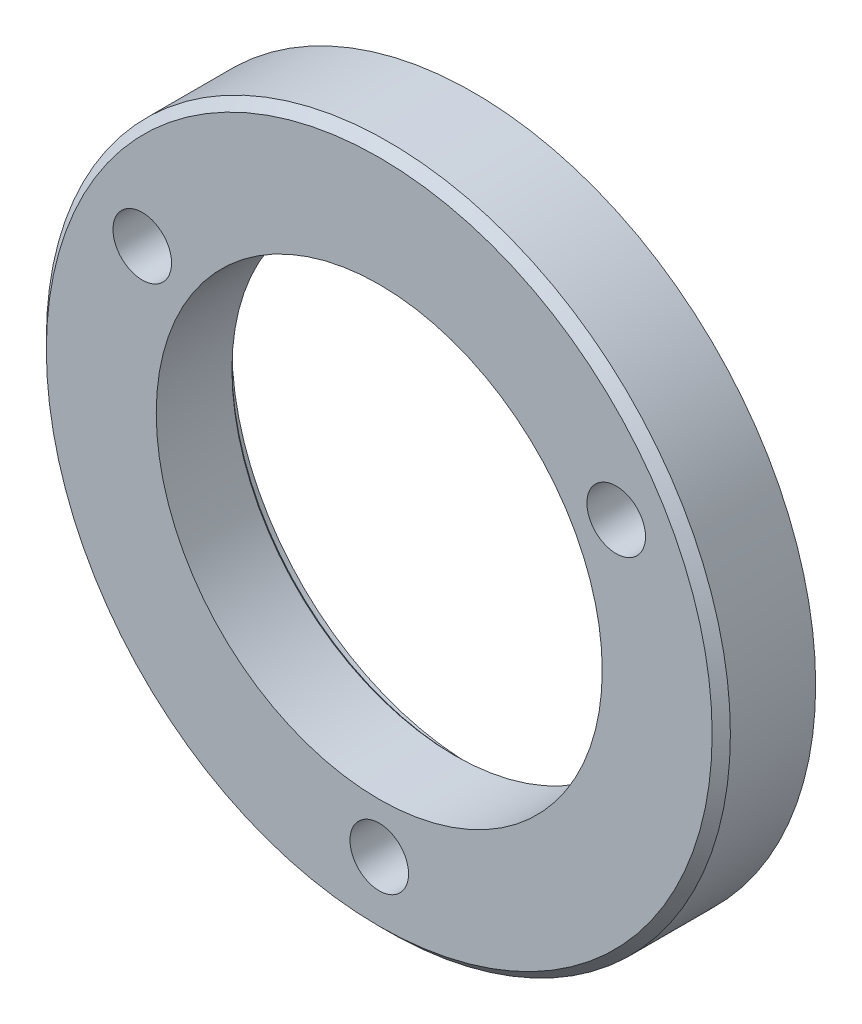
ISO-10303-21;
HEADER;
FILE_DESCRIPTION(('STEP AP214'),'2;1');
FILE_NAME('part.step','',(''),(''),'','','');
FILE_SCHEMA(('AUTOMOTIVE_DESIGN { 1 0 10303 214 1 1 1 1 }'));
ENDSEC;
DATA;
#1=APPLICATION_CONTEXT('core data for automotive mechanical design processes');
#2=APPLICATION_PROTOCOL_DEFINITION('international standard','automotive_design',2000,#1);
#3=PRODUCT_CONTEXT('',#1,'mechanical');
#4=PRODUCT('Part','Part','',(#3));
#5=PRODUCT_RELATED_PRODUCT_CATEGORY('part','',(#4));
#6=PRODUCT_DEFINITION_FORMATION('','',#4);
#7=PRODUCT_DEFINITION_CONTEXT('part definition',#1,'design');
#8=PRODUCT_DEFINITION('design','',#6,#7);
#9=PRODUCT_DEFINITION_SHAPE('','',#8);
#10=(LENGTH_UNIT() NAMED_UNIT(*) SI_UNIT(.MILLI.,.METRE.));
#11=(NAMED_UNIT(*) PLANE_ANGLE_UNIT() SI_UNIT($,.RADIAN.));
#12=(NAMED_UNIT(*) SI_UNIT($,.STERADIAN.) SOLID_ANGLE_UNIT());
#13=UNCERTAINTY_MEASURE_WITH_UNIT(LENGTH_MEASURE(1.E-05),#10,'distance_accuracy_value','');
#14=(GEOMETRIC_REPRESENTATION_CONTEXT(3) GLOBAL_UNCERTAINTY_ASSIGNED_CONTEXT((#13)) GLOBAL_UNIT_ASSIGNED_CONTEXT((#10,
#11,#12)) REPRESENTATION_CONTEXT('',''));
#15=CARTESIAN_POINT('',(0.,0.,0.));
#16=DIRECTION('',(0.,0.,1.));
#17=DIRECTION('',(1.,0.,0.));
#18=AXIS2_PLACEMENT_3D('',#15,#16,#17);
#19=CARTESIAN_POINT('',(-8.51449043835902,61.3890451015479,4.3688));
#20=DIRECTION('',(0.,0.,1.));
#21=DIRECTION('',(1.,0.,0.));
#22=AXIS2_PLACEMENT_3D('',#19,#20,#21);
#23=PLANE('',#22);
#24=CARTESIAN_POINT('',(-8.51449043835902,61.3890451015479,4.3688));
#25=DIRECTION('',(0.,0.,1.));
#26=DIRECTION('',(1.,0.,0.));
#27=AXIS2_PLACEMENT_3D('',#24,#25,#26);
#28=CIRCLE('',#27,18.542);
#29=CARTESIAN_POINT('',(10.027509561641,61.3890451015479,4.3688));
#30=VERTEX_POINT('',#29);
#31=EDGE_CURVE('E157',#30,#30,#28,.T.);
#32=ORIENTED_EDGE('',*,*,#31,.T.);
#33=EDGE_LOOP('',(#32));
#34=FACE_BOUND('',#33,.T.);
#35=CARTESIAN_POINT('',(4.68373671531574,69.0504183258604,4.3688));
#36=DIRECTION('',(0.,0.,1.));
#37=DIRECTION('',(1.,0.,0.));
#38=AXIS2_PLACEMENT_3D('',#35,#36,#37);
#39=CIRCLE('',#38,1.63194999999999);
#40=CARTESIAN_POINT('',(6.31568671531573,69.0504183258604,4.3688));
#41=VERTEX_POINT('',#40);
#42=EDGE_CURVE('E197',#41,#41,#39,.T.);
#43=ORIENTED_EDGE('',*,*,#42,.F.);
#44=EDGE_LOOP('',(#43));
#45=FACE_BOUND('',#44,.T.);
#46=CARTESIAN_POINT('',(-21.7127175920339,69.0504183258604,4.3688));
#47=DIRECTION('',(0.,0.,1.));
#48=DIRECTION('',(1.,0.,0.));
#49=AXIS2_PLACEMENT_3D('',#46,#47,#48);
#50=CIRCLE('',#49,1.63194999999999);
#51=CARTESIAN_POINT('',(-20.0807675920339,69.0504183258604,4.3688));
#52=VERTEX_POINT('',#51);
#53=EDGE_CURVE('E191',#52,#52,#50,.T.);
#54=ORIENTED_EDGE('',*,*,#53,.F.);
#55=EDGE_LOOP('',(#54));
#56=FACE_BOUND('',#55,.T.);
#57=CARTESIAN_POINT('',(-8.51449043835907,46.1904183258603,4.3688));
#58=DIRECTION('',(0.,0.,1.));
#59=DIRECTION('',(1.,0.,0.));
#60=AXIS2_PLACEMENT_3D('',#57,#58,#59);
#61=CIRCLE('',#60,1.63194999999999);
#62=CARTESIAN_POINT('',(-6.88254043835908,46.1904183258603,4.3688));
#63=VERTEX_POINT('',#62);
#64=EDGE_CURVE('E185',#63,#63,#61,.T.);
#65=ORIENTED_EDGE('',*,*,#64,.F.);
#66=EDGE_LOOP('',(#65));
#67=FACE_BOUND('',#66,.T.);
#68=CARTESIAN_POINT('',(-8.51449043835902,61.3890451015479,4.3688));
#69=DIRECTION('',(0.,0.,1.));
#70=DIRECTION('',(1.,0.,0.));
#71=AXIS2_PLACEMENT_3D('',#68,#69,#70);
#72=CIRCLE('',#71,12.4206);
#73=CARTESIAN_POINT('',(3.90610956164097,61.3890451015479,4.3688));
#74=VERTEX_POINT('',#73);
#75=EDGE_CURVE('E170',#74,#74,#72,.T.);
#76=ORIENTED_EDGE('',*,*,#75,.F.);
#77=EDGE_LOOP('',(#76));
#78=FACE_BOUND('',#77,.T.);
#79=ADVANCED_FACE('F150',(#34,#45,#56,#67,#78),#23,.T.);
#80=CARTESIAN_POINT('',(-8.51449043835902,61.3890451015479,0.));
#81=DIRECTION('',(0.,0.,1.));
#82=DIRECTION('',(1.,0.,0.));
#83=AXIS2_PLACEMENT_3D('',#80,#81,#82);
#84=PLANE('',#83);
#85=CARTESIAN_POINT('',(-8.51449043835902,61.3890451015479,0.));
#86=DIRECTION('',(0.,0.,1.));
#87=DIRECTION('',(1.,0.,0.));
#88=AXIS2_PLACEMENT_3D('',#85,#86,#87);
#89=CIRCLE('',#88,12.573);
#90=CARTESIAN_POINT('',(4.05850956164098,61.3890451015479,0.));
#91=VERTEX_POINT('',#90);
#92=EDGE_CURVE('E165',#91,#91,#89,.T.);
#93=ORIENTED_EDGE('',*,*,#92,.T.);
#94=EDGE_LOOP('',(#93));
#95=FACE_BOUND('',#94,.T.);
#96=CARTESIAN_POINT('',(-8.51449043835902,61.3890451015479,0.));
#97=DIRECTION('',(0.,0.,-1.));
#98=DIRECTION('',(-1.,0.,0.));
#99=AXIS2_PLACEMENT_3D('',#96,#97,#98);
#100=CIRCLE('',#99,13.462);
#101=CARTESIAN_POINT('',(-21.976490438359,61.3890451015479,0.));
#102=VERTEX_POINT('',#101);
#103=EDGE_CURVE('E177',#102,#102,#100,.T.);
#104=ORIENTED_EDGE('',*,*,#103,.T.);
#105=EDGE_LOOP('',(#104));
#106=FACE_BOUND('',#105,.T.);
#107=ADVANCED_FACE('F205',(#95,#106),#84,.F.);
#108=CARTESIAN_POINT('',(-8.51449043835902,61.3890451015479,4.3688));
#109=DIRECTION('',(0.,0.,-1.));
#110=DIRECTION('',(-1.,0.,0.));
#111=AXIS2_PLACEMENT_3D('',#108,#109,#110);
#112=CYLINDRICAL_SURFACE('',#111,19.05);
#113=CARTESIAN_POINT('',(-8.51449043835902,61.3890451015479,3.86079999999997));
#114=DIRECTION('',(0.,0.,1.));
#115=DIRECTION('',(1.,0.,0.));
#116=AXIS2_PLACEMENT_3D('',#113,#114,#115);
#117=CIRCLE('',#116,19.05);
#118=CARTESIAN_POINT('',(10.535509561641,61.3890451015479,3.86079999999997));
#119=VERTEX_POINT('',#118);
#120=EDGE_CURVE('E11',#119,#119,#117,.F.);
#121=ORIENTED_EDGE('',*,*,#120,.T.);
#122=EDGE_LOOP('',(#121));
#123=FACE_BOUND('',#122,.T.);
#124=CARTESIAN_POINT('',(-8.51449043835902,61.3890451015479,-0.889));
#125=DIRECTION('',(0.,0.,-1.));
#126=DIRECTION('',(-1.,0.,0.));
#127=AXIS2_PLACEMENT_3D('',#124,#125,#126);
#128=CIRCLE('',#127,19.05);
#129=CARTESIAN_POINT('',(-27.564490438359,61.3890451015479,-0.889));
#130=VERTEX_POINT('',#129);
#131=EDGE_CURVE('E173',#130,#130,#128,.T.);
#132=ORIENTED_EDGE('',*,*,#131,.F.);
#133=EDGE_LOOP('',(#132));
#134=FACE_BOUND('',#133,.T.);
#135=ADVANCED_FACE('F216',(#123,#134),#112,.T.);
#136=CARTESIAN_POINT('',(-8.51449043835902,61.3890451015479,4.3688));
#137=DIRECTION('',(0.,0.,-1.));
#138=DIRECTION('',(-1.,0.,0.));
#139=AXIS2_PLACEMENT_3D('',#136,#137,#138);
#140=CYLINDRICAL_SURFACE('',#139,12.4206);
#141=CARTESIAN_POINT('',(-8.51449043835902,61.3890451015479,0.1524));
#142=DIRECTION('',(0.,0.,1.));
#143=DIRECTION('',(1.,0.,0.));
#144=AXIS2_PLACEMENT_3D('',#141,#142,#143);
#145=CIRCLE('',#144,12.4206);
#146=CARTESIAN_POINT('',(3.90610956164097,61.3890451015479,0.1524));
#147=VERTEX_POINT('',#146);
#148=EDGE_CURVE('E161',#147,#147,#145,.F.);
#149=ORIENTED_EDGE('',*,*,#148,.T.);
#150=EDGE_LOOP('',(#149));
#151=FACE_BOUND('',#150,.T.);
#152=ORIENTED_EDGE('',*,*,#75,.T.);
#153=EDGE_LOOP('',(#152));
#154=FACE_BOUND('',#153,.T.);
#155=ADVANCED_FACE('F213',(#151,#154),#140,.F.);
#156=CARTESIAN_POINT('',(-8.51449043835902,61.3890451015479,-0.889));
#157=DIRECTION('',(0.,0.,-1.));
#158=DIRECTION('',(-1.,0.,0.));
#159=AXIS2_PLACEMENT_3D('',#156,#157,#158);
#160=PLANE('',#159);
#161=CARTESIAN_POINT('',(4.68373671531574,69.0504183258604,-0.889));
#162=DIRECTION('',(0.,0.,1.));
#163=DIRECTION('',(1.,0.,0.));
#164=AXIS2_PLACEMENT_3D('',#161,#162,#163);
#165=CIRCLE('',#164,1.63195);
#166=CARTESIAN_POINT('',(6.31568671531574,69.0504183258604,-0.889));
#167=VERTEX_POINT('',#166);
#168=EDGE_CURVE('E194',#167,#167,#165,.T.);
#169=ORIENTED_EDGE('',*,*,#168,.T.);
#170=EDGE_LOOP('',(#169));
#171=FACE_BOUND('',#170,.T.);
#172=CARTESIAN_POINT('',(-21.7127175920339,69.0504183258604,-0.889));
#173=DIRECTION('',(0.,0.,1.));
#174=DIRECTION('',(1.,0.,0.));
#175=AXIS2_PLACEMENT_3D('',#172,#173,#174);
#176=CIRCLE('',#175,1.63195);
#177=CARTESIAN_POINT('',(-20.0807675920339,69.0504183258604,-0.889));
#178=VERTEX_POINT('',#177);
#179=EDGE_CURVE('E188',#178,#178,#176,.T.);
#180=ORIENTED_EDGE('',*,*,#179,.T.);
#181=EDGE_LOOP('',(#180));
#182=FACE_BOUND('',#181,.T.);
#183=CARTESIAN_POINT('',(-8.51449043835907,46.1904183258603,-0.889));
#184=DIRECTION('',(0.,0.,1.));
#185=DIRECTION('',(1.,0.,0.));
#186=AXIS2_PLACEMENT_3D('',#183,#184,#185);
#187=CIRCLE('',#186,1.63195);
#188=CARTESIAN_POINT('',(-6.88254043835907,46.1904183258603,-0.889));
#189=VERTEX_POINT('',#188);
#190=EDGE_CURVE('E180',#189,#189,#187,.T.);
#191=ORIENTED_EDGE('',*,*,#190,.T.);
#192=EDGE_LOOP('',(#191));
#193=FACE_BOUND('',#192,.T.);
#194=ORIENTED_EDGE('',*,*,#131,.T.);
#195=EDGE_LOOP('',(#194));
#196=FACE_BOUND('',#195,.T.);
#197=CARTESIAN_POINT('',(-8.51449043835902,61.3890451015479,-0.889));
#198=DIRECTION('',(0.,0.,-1.));
#199=DIRECTION('',(-1.,0.,0.));
#200=AXIS2_PLACEMENT_3D('',#197,#198,#199);
#201=CIRCLE('',#200,13.462);
#202=CARTESIAN_POINT('',(-21.976490438359,61.3890451015479,-0.889));
#203=VERTEX_POINT('',#202);
#204=EDGE_CURVE('E176',#203,#203,#201,.T.);
#205=ORIENTED_EDGE('',*,*,#204,.F.);
#206=EDGE_LOOP('',(#205));
#207=FACE_BOUND('',#206,.T.);
#208=ADVANCED_FACE('F215',(#171,#182,#193,#196,#207),#160,.T.);
#209=CARTESIAN_POINT('',(-8.51449043835902,61.3890451015479,-0.889));
#210=DIRECTION('',(0.,0.,1.));
#211=DIRECTION('',(1.,0.,0.));
#212=AXIS2_PLACEMENT_3D('',#209,#210,#211);
#213=CYLINDRICAL_SURFACE('',#212,13.462);
#214=ORIENTED_EDGE('',*,*,#204,.T.);
#215=EDGE_LOOP('',(#214));
#216=FACE_BOUND('',#215,.T.);
#217=ORIENTED_EDGE('',*,*,#103,.F.);
#218=EDGE_LOOP('',(#217));
#219=FACE_BOUND('',#218,.T.);
#220=ADVANCED_FACE('F223',(#216,#219),#213,.F.);
#221=CARTESIAN_POINT('',(-8.51449043835907,46.1904183258603,4.3688));
#222=DIRECTION('',(0.,0.,1.));
#223=DIRECTION('',(1.,0.,0.));
#224=AXIS2_PLACEMENT_3D('',#221,#222,#223);
#225=CYLINDRICAL_SURFACE('',#224,1.63194999999999);
#226=ORIENTED_EDGE('',*,*,#190,.F.);
#227=EDGE_LOOP('',(#226));
#228=FACE_BOUND('',#227,.T.);
#229=ORIENTED_EDGE('',*,*,#64,.T.);
#230=EDGE_LOOP('',(#229));
#231=FACE_BOUND('',#230,.T.);
#232=ADVANCED_FACE('F249',(#228,#231),#225,.F.);
#233=CARTESIAN_POINT('',(-21.7127175920339,69.0504183258604,4.3688));
#234=DIRECTION('',(0.,0.,1.));
#235=DIRECTION('',(1.,0.,0.));
#236=AXIS2_PLACEMENT_3D('',#233,#234,#235);
#237=CYLINDRICAL_SURFACE('',#236,1.63194999999999);
#238=ORIENTED_EDGE('',*,*,#179,.F.);
#239=EDGE_LOOP('',(#238));
#240=FACE_BOUND('',#239,.T.);
#241=ORIENTED_EDGE('',*,*,#53,.T.);
#242=EDGE_LOOP('',(#241));
#243=FACE_BOUND('',#242,.T.);
#244=ADVANCED_FACE('F239',(#240,#243),#237,.F.);
#245=CARTESIAN_POINT('',(4.68373671531574,69.0504183258604,4.3688));
#246=DIRECTION('',(0.,0.,1.));
#247=DIRECTION('',(1.,0.,0.));
#248=AXIS2_PLACEMENT_3D('',#245,#246,#247);
#249=CYLINDRICAL_SURFACE('',#248,1.63194999999999);
#250=ORIENTED_EDGE('',*,*,#168,.F.);
#251=EDGE_LOOP('',(#250));
#252=FACE_BOUND('',#251,.T.);
#253=ORIENTED_EDGE('',*,*,#42,.T.);
#254=EDGE_LOOP('',(#253));
#255=FACE_BOUND('',#254,.T.);
#256=ADVANCED_FACE('F201',(#252,#255),#249,.F.);
#257=CARTESIAN_POINT('',(-8.51449043835902,61.3890451015479,0.));
#258=DIRECTION('',(0.,0.,-1.));
#259=DIRECTION('',(-1.,0.,0.));
#260=AXIS2_PLACEMENT_3D('',#257,#258,#259);
#261=CONICAL_SURFACE('',#260,12.573,0.78539816339746);
#262=ORIENTED_EDGE('',*,*,#148,.F.);
#263=EDGE_LOOP('',(#262));
#264=FACE_BOUND('',#263,.T.);
#265=ORIENTED_EDGE('',*,*,#92,.F.);
#266=EDGE_LOOP('',(#265));
#267=FACE_BOUND('',#266,.T.);
#268=ADVANCED_FACE('F231',(#264,#267),#261,.F.);
#269=CARTESIAN_POINT('',(-8.51449043835902,61.3890451015479,4.3688));
#270=DIRECTION('',(0.,0.,-1.));
#271=DIRECTION('',(-1.,0.,0.));
#272=AXIS2_PLACEMENT_3D('',#269,#270,#271);
#273=CONICAL_SURFACE('',#272,18.542,0.785398163397445);
#274=ORIENTED_EDGE('',*,*,#120,.F.);
#275=EDGE_LOOP('',(#274));
#276=FACE_BOUND('',#275,.T.);
#277=ORIENTED_EDGE('',*,*,#31,.F.);
#278=EDGE_LOOP('',(#277));
#279=FACE_BOUND('',#278,.T.);
#280=ADVANCED_FACE('F152',(#276,#279),#273,.T.);
#281=CLOSED_SHELL('',(#79,#107,#135,#155,#208,#220,#232,#244,#256,#268,#280));
#282=MANIFOLD_SOLID_BREP('B2',#281);
#283=ADVANCED_BREP_SHAPE_REPRESENTATION('',(#18,#282),#14);
#284=SHAPE_DEFINITION_REPRESENTATION(#9,#283);
ENDSEC;
END-ISO-10303-21;
